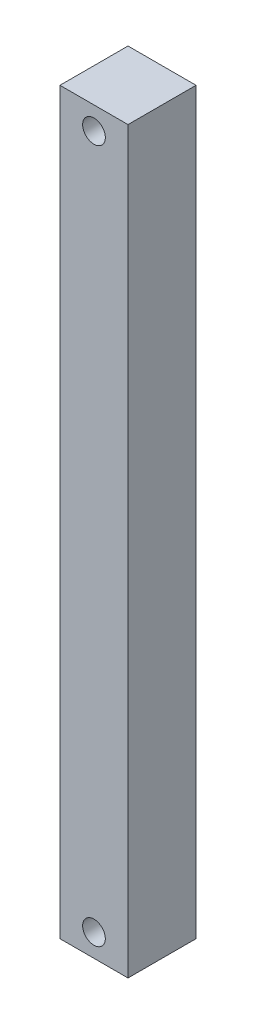
ISO-10303-21;
HEADER;
FILE_DESCRIPTION(('STEP AP214'),'2;1');
FILE_NAME('part.step','',(''),(''),'','','');
FILE_SCHEMA(('AUTOMOTIVE_DESIGN { 1 0 10303 214 1 1 1 1 }'));
ENDSEC;
DATA;
#1=APPLICATION_CONTEXT('core data for automotive mechanical design processes');
#2=APPLICATION_PROTOCOL_DEFINITION('international standard','automotive_design',2000,#1);
#3=PRODUCT_CONTEXT('',#1,'mechanical');
#4=PRODUCT('Part','Part','',(#3));
#5=PRODUCT_RELATED_PRODUCT_CATEGORY('part','',(#4));
#6=PRODUCT_DEFINITION_FORMATION('','',#4);
#7=PRODUCT_DEFINITION_CONTEXT('part definition',#1,'design');
#8=PRODUCT_DEFINITION('design','',#6,#7);
#9=PRODUCT_DEFINITION_SHAPE('','',#8);
#10=(LENGTH_UNIT() NAMED_UNIT(*) SI_UNIT(.MILLI.,.METRE.));
#11=(NAMED_UNIT(*) PLANE_ANGLE_UNIT() SI_UNIT($,.RADIAN.));
#12=(NAMED_UNIT(*) SI_UNIT($,.STERADIAN.) SOLID_ANGLE_UNIT());
#13=UNCERTAINTY_MEASURE_WITH_UNIT(LENGTH_MEASURE(1.E-05),#10,'distance_accuracy_value','');
#14=(GEOMETRIC_REPRESENTATION_CONTEXT(3) GLOBAL_UNCERTAINTY_ASSIGNED_CONTEXT((#13)) GLOBAL_UNIT_ASSIGNED_CONTEXT((#10,
#11,#12)) REPRESENTATION_CONTEXT('',''));
#15=CARTESIAN_POINT('',(0.,0.,0.));
#16=DIRECTION('',(0.,0.,1.));
#17=DIRECTION('',(1.,0.,0.));
#18=AXIS2_PLACEMENT_3D('',#15,#16,#17);
#19=CARTESIAN_POINT('',(1.5,32.59,-1.5));
#20=DIRECTION('',(-1.,0.,0.));
#21=DIRECTION('',(0.,0.,1.));
#22=AXIS2_PLACEMENT_3D('',#19,#20,#21);
#23=PLANE('',#22);
#24=DIRECTION('',(0.,0.,-1.));
#25=VECTOR('',#24,1.);
#26=CARTESIAN_POINT('',(1.5,0.,-1.5));
#27=LINE('',#26,#25);
#28=CARTESIAN_POINT('',(1.5,0.,1.5));
#29=VERTEX_POINT('',#28);
#30=CARTESIAN_POINT('',(1.5,0.,-1.5));
#31=VERTEX_POINT('',#30);
#32=EDGE_CURVE('E107',#29,#31,#27,.T.);
#33=ORIENTED_EDGE('',*,*,#32,.T.);
#34=DIRECTION('',(0.,-1.,0.));
#35=VECTOR('',#34,1.);
#36=CARTESIAN_POINT('',(1.5,32.59,-1.5));
#37=LINE('',#36,#35);
#38=CARTESIAN_POINT('',(1.5,32.59,-1.5));
#39=VERTEX_POINT('',#38);
#40=EDGE_CURVE('E11',#39,#31,#37,.T.);
#41=ORIENTED_EDGE('',*,*,#40,.F.);
#42=DIRECTION('',(0.,0.,-1.));
#43=VECTOR('',#42,1.);
#44=CARTESIAN_POINT('',(1.5,32.59,-1.5));
#45=LINE('',#44,#43);
#46=CARTESIAN_POINT('',(1.5,32.59,1.5));
#47=VERTEX_POINT('',#46);
#48=EDGE_CURVE('E91',#47,#39,#45,.T.);
#49=ORIENTED_EDGE('',*,*,#48,.F.);
#50=DIRECTION('',(0.,-1.,0.));
#51=VECTOR('',#50,1.);
#52=CARTESIAN_POINT('',(1.5,32.59,1.5));
#53=LINE('',#52,#51);
#54=EDGE_CURVE('E103',#47,#29,#53,.T.);
#55=ORIENTED_EDGE('',*,*,#54,.T.);
#56=EDGE_LOOP('',(#33,#41,#49,#55));
#57=FACE_BOUND('',#56,.T.);
#58=ADVANCED_FACE('F39',(#57),#23,.F.);
#59=CARTESIAN_POINT('',(-1.5,32.59,-1.5));
#60=DIRECTION('',(0.,0.,1.));
#61=DIRECTION('',(1.,0.,0.));
#62=AXIS2_PLACEMENT_3D('',#59,#60,#61);
#63=PLANE('',#62);
#64=CARTESIAN_POINT('',(0.,31.59,-1.5));
#65=DIRECTION('',(0.,0.,1.));
#66=DIRECTION('',(1.,0.,0.));
#67=AXIS2_PLACEMENT_3D('',#64,#65,#66);
#68=CIRCLE('',#67,0.500716242452653);
#69=CARTESIAN_POINT('',(0.500716242452653,31.59,-1.5));
#70=VERTEX_POINT('',#69);
#71=EDGE_CURVE('E132',#70,#70,#68,.F.);
#72=ORIENTED_EDGE('',*,*,#71,.F.);
#73=EDGE_LOOP('',(#72));
#74=FACE_BOUND('',#73,.T.);
#75=CARTESIAN_POINT('',(0.,1.,-1.5));
#76=DIRECTION('',(0.,0.,1.));
#77=DIRECTION('',(1.,0.,0.));
#78=AXIS2_PLACEMENT_3D('',#75,#76,#77);
#79=CIRCLE('',#78,0.5);
#80=CARTESIAN_POINT('',(0.5,1.,-1.5));
#81=VERTEX_POINT('',#80);
#82=EDGE_CURVE('E111',#81,#81,#79,.T.);
#83=ORIENTED_EDGE('',*,*,#82,.T.);
#84=EDGE_LOOP('',(#83));
#85=FACE_BOUND('',#84,.T.);
#86=DIRECTION('',(-1.,0.,0.));
#87=VECTOR('',#86,1.);
#88=CARTESIAN_POINT('',(-1.5,0.,-1.5));
#89=LINE('',#88,#87);
#90=CARTESIAN_POINT('',(-1.5,0.,-1.5));
#91=VERTEX_POINT('',#90);
#92=EDGE_CURVE('E96',#31,#91,#89,.T.);
#93=ORIENTED_EDGE('',*,*,#92,.T.);
#94=DIRECTION('',(0.,-1.,0.));
#95=VECTOR('',#94,1.);
#96=CARTESIAN_POINT('',(-1.5,32.59,-1.5));
#97=LINE('',#96,#95);
#98=CARTESIAN_POINT('',(-1.5,32.59,-1.5));
#99=VERTEX_POINT('',#98);
#100=EDGE_CURVE('E48',#99,#91,#97,.T.);
#101=ORIENTED_EDGE('',*,*,#100,.F.);
#102=DIRECTION('',(-1.,0.,0.));
#103=VECTOR('',#102,1.);
#104=CARTESIAN_POINT('',(-1.5,32.59,-1.5));
#105=LINE('',#104,#103);
#106=EDGE_CURVE('E86',#39,#99,#105,.T.);
#107=ORIENTED_EDGE('',*,*,#106,.F.);
#108=ORIENTED_EDGE('',*,*,#40,.T.);
#109=EDGE_LOOP('',(#93,#101,#107,#108));
#110=FACE_BOUND('',#109,.T.);
#111=ADVANCED_FACE('F95',(#74,#85,#110),#63,.F.);
#112=CARTESIAN_POINT('',(-1.5,32.59,-1.5));
#113=DIRECTION('',(1.,0.,0.));
#114=DIRECTION('',(0.,0.,-1.));
#115=AXIS2_PLACEMENT_3D('',#112,#113,#114);
#116=PLANE('',#115);
#117=DIRECTION('',(0.,0.,1.));
#118=VECTOR('',#117,1.);
#119=CARTESIAN_POINT('',(-1.5,0.,-1.5));
#120=LINE('',#119,#118);
#121=CARTESIAN_POINT('',(-1.5,0.,1.5));
#122=VERTEX_POINT('',#121);
#123=EDGE_CURVE('E73',#91,#122,#120,.T.);
#124=ORIENTED_EDGE('',*,*,#123,.T.);
#125=DIRECTION('',(0.,-1.,0.));
#126=VECTOR('',#125,1.);
#127=CARTESIAN_POINT('',(-1.5,32.59,1.5));
#128=LINE('',#127,#126);
#129=CARTESIAN_POINT('',(-1.5,32.59,1.5));
#130=VERTEX_POINT('',#129);
#131=EDGE_CURVE('E98',#130,#122,#128,.T.);
#132=ORIENTED_EDGE('',*,*,#131,.F.);
#133=DIRECTION('',(0.,0.,1.));
#134=VECTOR('',#133,1.);
#135=CARTESIAN_POINT('',(-1.5,32.59,-1.5));
#136=LINE('',#135,#134);
#137=EDGE_CURVE('E89',#99,#130,#136,.T.);
#138=ORIENTED_EDGE('',*,*,#137,.F.);
#139=ORIENTED_EDGE('',*,*,#100,.T.);
#140=EDGE_LOOP('',(#124,#132,#138,#139));
#141=FACE_BOUND('',#140,.T.);
#142=ADVANCED_FACE('F99',(#141),#116,.F.);
#143=CARTESIAN_POINT('',(-1.5,32.59,1.5));
#144=DIRECTION('',(0.,0.,-1.));
#145=DIRECTION('',(-1.,0.,0.));
#146=AXIS2_PLACEMENT_3D('',#143,#144,#145);
#147=PLANE('',#146);
#148=CARTESIAN_POINT('',(0.,31.59,1.5));
#149=DIRECTION('',(0.,0.,1.));
#150=DIRECTION('',(1.,0.,0.));
#151=AXIS2_PLACEMENT_3D('',#148,#149,#150);
#152=CIRCLE('',#151,0.500716242452653);
#153=CARTESIAN_POINT('',(0.500716242452653,31.59,1.5));
#154=VERTEX_POINT('',#153);
#155=EDGE_CURVE('E139',#154,#154,#152,.T.);
#156=ORIENTED_EDGE('',*,*,#155,.F.);
#157=EDGE_LOOP('',(#156));
#158=FACE_BOUND('',#157,.T.);
#159=CARTESIAN_POINT('',(0.,1.,1.5));
#160=DIRECTION('',(0.,0.,1.));
#161=DIRECTION('',(1.,0.,0.));
#162=AXIS2_PLACEMENT_3D('',#159,#160,#161);
#163=CIRCLE('',#162,0.5);
#164=CARTESIAN_POINT('',(0.5,1.,1.5));
#165=VERTEX_POINT('',#164);
#166=EDGE_CURVE('E128',#165,#165,#163,.T.);
#167=ORIENTED_EDGE('',*,*,#166,.F.);
#168=EDGE_LOOP('',(#167));
#169=FACE_BOUND('',#168,.T.);
#170=DIRECTION('',(1.,0.,0.));
#171=VECTOR('',#170,1.);
#172=CARTESIAN_POINT('',(-1.5,0.,1.5));
#173=LINE('',#172,#171);
#174=EDGE_CURVE('E79',#122,#29,#173,.T.);
#175=ORIENTED_EDGE('',*,*,#174,.T.);
#176=ORIENTED_EDGE('',*,*,#54,.F.);
#177=DIRECTION('',(1.,0.,0.));
#178=VECTOR('',#177,1.);
#179=CARTESIAN_POINT('',(-1.5,32.59,1.5));
#180=LINE('',#179,#178);
#181=EDGE_CURVE('E56',#130,#47,#180,.T.);
#182=ORIENTED_EDGE('',*,*,#181,.F.);
#183=ORIENTED_EDGE('',*,*,#131,.T.);
#184=EDGE_LOOP('',(#175,#176,#182,#183));
#185=FACE_BOUND('',#184,.T.);
#186=ADVANCED_FACE('F121',(#158,#169,#185),#147,.F.);
#187=CARTESIAN_POINT('',(0.,32.59,0.));
#188=DIRECTION('',(0.,1.,0.));
#189=DIRECTION('',(0.,0.,1.));
#190=AXIS2_PLACEMENT_3D('',#187,#188,#189);
#191=PLANE('',#190);
#192=ORIENTED_EDGE('',*,*,#48,.T.);
#193=ORIENTED_EDGE('',*,*,#106,.T.);
#194=ORIENTED_EDGE('',*,*,#137,.T.);
#195=ORIENTED_EDGE('',*,*,#181,.T.);
#196=EDGE_LOOP('',(#192,#193,#194,#195));
#197=FACE_BOUND('',#196,.T.);
#198=ADVANCED_FACE('F87',(#197),#191,.T.);
#199=CARTESIAN_POINT('',(0.,0.,0.));
#200=DIRECTION('',(0.,1.,0.));
#201=DIRECTION('',(0.,0.,1.));
#202=AXIS2_PLACEMENT_3D('',#199,#200,#201);
#203=PLANE('',#202);
#204=ORIENTED_EDGE('',*,*,#32,.F.);
#205=ORIENTED_EDGE('',*,*,#174,.F.);
#206=ORIENTED_EDGE('',*,*,#123,.F.);
#207=ORIENTED_EDGE('',*,*,#92,.F.);
#208=EDGE_LOOP('',(#204,#205,#206,#207));
#209=FACE_BOUND('',#208,.T.);
#210=ADVANCED_FACE('F124',(#209),#203,.F.);
#211=CARTESIAN_POINT('',(0.,1.,-1.5));
#212=DIRECTION('',(0.,0.,1.));
#213=DIRECTION('',(1.,0.,0.));
#214=AXIS2_PLACEMENT_3D('',#211,#212,#213);
#215=CYLINDRICAL_SURFACE('',#214,0.5);
#216=ORIENTED_EDGE('',*,*,#82,.F.);
#217=EDGE_LOOP('',(#216));
#218=FACE_BOUND('',#217,.T.);
#219=ORIENTED_EDGE('',*,*,#166,.T.);
#220=EDGE_LOOP('',(#219));
#221=FACE_BOUND('',#220,.T.);
#222=ADVANCED_FACE('F152',(#218,#221),#215,.F.);
#223=CARTESIAN_POINT('',(0.,31.59,-1.501));
#224=DIRECTION('',(0.,0.,1.));
#225=DIRECTION('',(1.,0.,0.));
#226=AXIS2_PLACEMENT_3D('',#223,#224,#225);
#227=CYLINDRICAL_SURFACE('',#226,0.500716242452653);
#228=ORIENTED_EDGE('',*,*,#155,.T.);
#229=EDGE_LOOP('',(#228));
#230=FACE_BOUND('',#229,.T.);
#231=ORIENTED_EDGE('',*,*,#71,.T.);
#232=EDGE_LOOP('',(#231));
#233=FACE_BOUND('',#232,.T.);
#234=ADVANCED_FACE('F144',(#230,#233),#227,.F.);
#235=CLOSED_SHELL('',(#58,#111,#142,#186,#198,#210,#222,#234));
#236=MANIFOLD_SOLID_BREP('B2',#235);
#237=ADVANCED_BREP_SHAPE_REPRESENTATION('',(#18,#236),#14);
#238=SHAPE_DEFINITION_REPRESENTATION(#9,#237);
ENDSEC;
END-ISO-10303-21;
